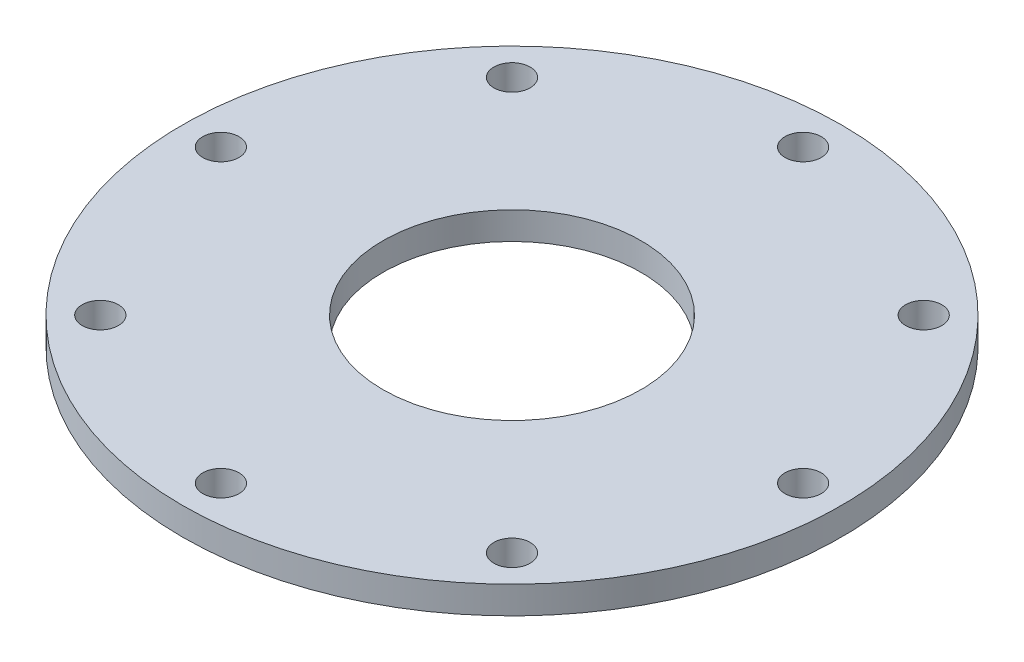
ISO-10303-21;
HEADER;
FILE_DESCRIPTION(('STEP AP214'),'2;1');
FILE_NAME('part.step','',(''),(''),'','','');
FILE_SCHEMA(('AUTOMOTIVE_DESIGN { 1 0 10303 214 1 1 1 1 }'));
ENDSEC;
DATA;
#1=APPLICATION_CONTEXT('core data for automotive mechanical design processes');
#2=APPLICATION_PROTOCOL_DEFINITION('international standard','automotive_design',2000,#1);
#3=PRODUCT_CONTEXT('',#1,'mechanical');
#4=PRODUCT('Part','Part','',(#3));
#5=PRODUCT_RELATED_PRODUCT_CATEGORY('part','',(#4));
#6=PRODUCT_DEFINITION_FORMATION('','',#4);
#7=PRODUCT_DEFINITION_CONTEXT('part definition',#1,'design');
#8=PRODUCT_DEFINITION('design','',#6,#7);
#9=PRODUCT_DEFINITION_SHAPE('','',#8);
#10=(LENGTH_UNIT() NAMED_UNIT(*) SI_UNIT(.MILLI.,.METRE.));
#11=(NAMED_UNIT(*) PLANE_ANGLE_UNIT() SI_UNIT($,.RADIAN.));
#12=(NAMED_UNIT(*) SI_UNIT($,.STERADIAN.) SOLID_ANGLE_UNIT());
#13=UNCERTAINTY_MEASURE_WITH_UNIT(LENGTH_MEASURE(1.E-05),#10,'distance_accuracy_value','');
#14=(GEOMETRIC_REPRESENTATION_CONTEXT(3) GLOBAL_UNCERTAINTY_ASSIGNED_CONTEXT((#13)) GLOBAL_UNIT_ASSIGNED_CONTEXT((#10,
#11,#12)) REPRESENTATION_CONTEXT('',''));
#15=CARTESIAN_POINT('',(0.,0.,0.));
#16=DIRECTION('',(0.,0.,1.));
#17=DIRECTION('',(1.,0.,0.));
#18=AXIS2_PLACEMENT_3D('',#15,#16,#17);
#19=CARTESIAN_POINT('',(0.,5.,0.));
#20=DIRECTION('',(0.,1.,0.));
#21=DIRECTION('',(0.,0.,1.));
#22=AXIS2_PLACEMENT_3D('',#19,#20,#21);
#23=PLANE('',#22);
#24=CARTESIAN_POINT('',(0.,5.,-53.));
#25=DIRECTION('',(0.,1.,0.));
#26=DIRECTION('',(0.,0.,1.));
#27=AXIS2_PLACEMENT_3D('',#24,#25,#26);
#28=CIRCLE('',#27,3.3);
#29=CARTESIAN_POINT('',(0.,5.,-49.7));
#30=VERTEX_POINT('',#29);
#31=EDGE_CURVE('E125',#30,#30,#28,.T.);
#32=ORIENTED_EDGE('',*,*,#31,.F.);
#33=EDGE_LOOP('',(#32));
#34=FACE_BOUND('',#33,.T.);
#35=CARTESIAN_POINT('',(37.476659402887,5.,-37.476659402887));
#36=DIRECTION('',(0.,1.,0.));
#37=DIRECTION('',(0.,0.,1.));
#38=AXIS2_PLACEMENT_3D('',#35,#36,#37);
#39=CIRCLE('',#38,3.3);
#40=CARTESIAN_POINT('',(37.476659402887,5.,-34.176659402887));
#41=VERTEX_POINT('',#40);
#42=EDGE_CURVE('E117',#41,#41,#39,.T.);
#43=ORIENTED_EDGE('',*,*,#42,.F.);
#44=EDGE_LOOP('',(#43));
#45=FACE_BOUND('',#44,.T.);
#46=CARTESIAN_POINT('',(53.,5.,0.));
#47=DIRECTION('',(0.,1.,0.));
#48=DIRECTION('',(0.,0.,1.));
#49=AXIS2_PLACEMENT_3D('',#46,#47,#48);
#50=CIRCLE('',#49,3.3);
#51=CARTESIAN_POINT('',(53.,5.,3.29999999999999));
#52=VERTEX_POINT('',#51);
#53=EDGE_CURVE('E109',#52,#52,#50,.T.);
#54=ORIENTED_EDGE('',*,*,#53,.F.);
#55=EDGE_LOOP('',(#54));
#56=FACE_BOUND('',#55,.T.);
#57=CARTESIAN_POINT('',(37.476659402887,5.,37.476659402887));
#58=DIRECTION('',(0.,1.,0.));
#59=DIRECTION('',(0.,0.,1.));
#60=AXIS2_PLACEMENT_3D('',#57,#58,#59);
#61=CIRCLE('',#60,3.3);
#62=CARTESIAN_POINT('',(37.476659402887,5.,40.776659402887));
#63=VERTEX_POINT('',#62);
#64=EDGE_CURVE('E101',#63,#63,#61,.T.);
#65=ORIENTED_EDGE('',*,*,#64,.F.);
#66=EDGE_LOOP('',(#65));
#67=FACE_BOUND('',#66,.T.);
#68=CARTESIAN_POINT('',(0.,5.,53.));
#69=DIRECTION('',(0.,1.,0.));
#70=DIRECTION('',(0.,0.,1.));
#71=AXIS2_PLACEMENT_3D('',#68,#69,#70);
#72=CIRCLE('',#71,3.3);
#73=CARTESIAN_POINT('',(0.,5.,56.3));
#74=VERTEX_POINT('',#73);
#75=EDGE_CURVE('E93',#74,#74,#72,.T.);
#76=ORIENTED_EDGE('',*,*,#75,.F.);
#77=EDGE_LOOP('',(#76));
#78=FACE_BOUND('',#77,.T.);
#79=CARTESIAN_POINT('',(-37.476659402887,5.,37.476659402887));
#80=DIRECTION('',(0.,1.,0.));
#81=DIRECTION('',(0.,0.,1.));
#82=AXIS2_PLACEMENT_3D('',#79,#80,#81);
#83=CIRCLE('',#82,3.3);
#84=CARTESIAN_POINT('',(-37.476659402887,5.,40.776659402887));
#85=VERTEX_POINT('',#84);
#86=EDGE_CURVE('E85',#85,#85,#83,.T.);
#87=ORIENTED_EDGE('',*,*,#86,.F.);
#88=EDGE_LOOP('',(#87));
#89=FACE_BOUND('',#88,.T.);
#90=CARTESIAN_POINT('',(-53.,5.,0.));
#91=DIRECTION('',(0.,1.,0.));
#92=DIRECTION('',(0.,0.,1.));
#93=AXIS2_PLACEMENT_3D('',#90,#91,#92);
#94=CIRCLE('',#93,3.3);
#95=CARTESIAN_POINT('',(-53.,5.,3.30000000000001));
#96=VERTEX_POINT('',#95);
#97=EDGE_CURVE('E77',#96,#96,#94,.T.);
#98=ORIENTED_EDGE('',*,*,#97,.F.);
#99=EDGE_LOOP('',(#98));
#100=FACE_BOUND('',#99,.T.);
#101=CARTESIAN_POINT('',(-37.476659402887,5.,-37.476659402887));
#102=DIRECTION('',(0.,1.,0.));
#103=DIRECTION('',(0.,0.,1.));
#104=AXIS2_PLACEMENT_3D('',#101,#102,#103);
#105=CIRCLE('',#104,3.3);
#106=CARTESIAN_POINT('',(-37.476659402887,5.,-34.176659402887));
#107=VERTEX_POINT('',#106);
#108=EDGE_CURVE('E69',#107,#107,#105,.T.);
#109=ORIENTED_EDGE('',*,*,#108,.F.);
#110=EDGE_LOOP('',(#109));
#111=FACE_BOUND('',#110,.T.);
#112=CARTESIAN_POINT('',(0.,5.,0.));
#113=DIRECTION('',(0.,1.,0.));
#114=DIRECTION('',(0.,0.,1.));
#115=AXIS2_PLACEMENT_3D('',#112,#113,#114);
#116=CIRCLE('',#115,60.);
#117=CARTESIAN_POINT('',(0.,5.,60.));
#118=VERTEX_POINT('',#117);
#119=EDGE_CURVE('E10',#118,#118,#116,.T.);
#120=ORIENTED_EDGE('',*,*,#119,.T.);
#121=EDGE_LOOP('',(#120));
#122=FACE_BOUND('',#121,.T.);
#123=CARTESIAN_POINT('',(0.,5.,0.));
#124=DIRECTION('',(0.,1.,0.));
#125=DIRECTION('',(0.,0.,1.));
#126=AXIS2_PLACEMENT_3D('',#123,#124,#125);
#127=CIRCLE('',#126,23.5);
#128=CARTESIAN_POINT('',(0.,5.,23.5));
#129=VERTEX_POINT('',#128);
#130=EDGE_CURVE('E56',#129,#129,#127,.T.);
#131=ORIENTED_EDGE('',*,*,#130,.F.);
#132=EDGE_LOOP('',(#131));
#133=FACE_BOUND('',#132,.T.);
#134=ADVANCED_FACE('F43',(#34,#45,#56,#67,#78,#89,#100,#111,#122,#133),#23,.T.);
#135=CARTESIAN_POINT('',(0.,0.,0.));
#136=DIRECTION('',(0.,1.,0.));
#137=DIRECTION('',(0.,0.,1.));
#138=AXIS2_PLACEMENT_3D('',#135,#136,#137);
#139=PLANE('',#138);
#140=CARTESIAN_POINT('',(0.,0.,-53.));
#141=DIRECTION('',(0.,1.,0.));
#142=DIRECTION('',(0.,0.,1.));
#143=AXIS2_PLACEMENT_3D('',#140,#141,#142);
#144=CIRCLE('',#143,3.3);
#145=CARTESIAN_POINT('',(0.,0.,-49.7));
#146=VERTEX_POINT('',#145);
#147=EDGE_CURVE('E121',#146,#146,#144,.T.);
#148=ORIENTED_EDGE('',*,*,#147,.T.);
#149=EDGE_LOOP('',(#148));
#150=FACE_BOUND('',#149,.T.);
#151=CARTESIAN_POINT('',(37.476659402887,0.,-37.476659402887));
#152=DIRECTION('',(0.,1.,0.));
#153=DIRECTION('',(0.,0.,1.));
#154=AXIS2_PLACEMENT_3D('',#151,#152,#153);
#155=CIRCLE('',#154,3.3);
#156=CARTESIAN_POINT('',(37.476659402887,0.,-34.176659402887));
#157=VERTEX_POINT('',#156);
#158=EDGE_CURVE('E113',#157,#157,#155,.T.);
#159=ORIENTED_EDGE('',*,*,#158,.T.);
#160=EDGE_LOOP('',(#159));
#161=FACE_BOUND('',#160,.T.);
#162=CARTESIAN_POINT('',(53.,0.,0.));
#163=DIRECTION('',(0.,1.,0.));
#164=DIRECTION('',(0.,0.,1.));
#165=AXIS2_PLACEMENT_3D('',#162,#163,#164);
#166=CIRCLE('',#165,3.3);
#167=CARTESIAN_POINT('',(53.,0.,3.29999999999999));
#168=VERTEX_POINT('',#167);
#169=EDGE_CURVE('E105',#168,#168,#166,.T.);
#170=ORIENTED_EDGE('',*,*,#169,.T.);
#171=EDGE_LOOP('',(#170));
#172=FACE_BOUND('',#171,.T.);
#173=CARTESIAN_POINT('',(37.476659402887,0.,37.476659402887));
#174=DIRECTION('',(0.,1.,0.));
#175=DIRECTION('',(0.,0.,1.));
#176=AXIS2_PLACEMENT_3D('',#173,#174,#175);
#177=CIRCLE('',#176,3.3);
#178=CARTESIAN_POINT('',(37.476659402887,0.,40.776659402887));
#179=VERTEX_POINT('',#178);
#180=EDGE_CURVE('E97',#179,#179,#177,.T.);
#181=ORIENTED_EDGE('',*,*,#180,.T.);
#182=EDGE_LOOP('',(#181));
#183=FACE_BOUND('',#182,.T.);
#184=CARTESIAN_POINT('',(0.,0.,53.));
#185=DIRECTION('',(0.,1.,0.));
#186=DIRECTION('',(0.,0.,1.));
#187=AXIS2_PLACEMENT_3D('',#184,#185,#186);
#188=CIRCLE('',#187,3.3);
#189=CARTESIAN_POINT('',(0.,0.,56.3));
#190=VERTEX_POINT('',#189);
#191=EDGE_CURVE('E89',#190,#190,#188,.T.);
#192=ORIENTED_EDGE('',*,*,#191,.T.);
#193=EDGE_LOOP('',(#192));
#194=FACE_BOUND('',#193,.T.);
#195=CARTESIAN_POINT('',(-37.476659402887,0.,37.476659402887));
#196=DIRECTION('',(0.,1.,0.));
#197=DIRECTION('',(0.,0.,1.));
#198=AXIS2_PLACEMENT_3D('',#195,#196,#197);
#199=CIRCLE('',#198,3.3);
#200=CARTESIAN_POINT('',(-37.476659402887,0.,40.776659402887));
#201=VERTEX_POINT('',#200);
#202=EDGE_CURVE('E81',#201,#201,#199,.T.);
#203=ORIENTED_EDGE('',*,*,#202,.T.);
#204=EDGE_LOOP('',(#203));
#205=FACE_BOUND('',#204,.T.);
#206=CARTESIAN_POINT('',(-53.,0.,0.));
#207=DIRECTION('',(0.,1.,0.));
#208=DIRECTION('',(0.,0.,1.));
#209=AXIS2_PLACEMENT_3D('',#206,#207,#208);
#210=CIRCLE('',#209,3.3);
#211=CARTESIAN_POINT('',(-53.,0.,3.30000000000001));
#212=VERTEX_POINT('',#211);
#213=EDGE_CURVE('E73',#212,#212,#210,.T.);
#214=ORIENTED_EDGE('',*,*,#213,.T.);
#215=EDGE_LOOP('',(#214));
#216=FACE_BOUND('',#215,.T.);
#217=CARTESIAN_POINT('',(-37.476659402887,0.,-37.476659402887));
#218=DIRECTION('',(0.,1.,0.));
#219=DIRECTION('',(0.,0.,1.));
#220=AXIS2_PLACEMENT_3D('',#217,#218,#219);
#221=CIRCLE('',#220,3.3);
#222=CARTESIAN_POINT('',(-37.476659402887,0.,-34.176659402887));
#223=VERTEX_POINT('',#222);
#224=EDGE_CURVE('E62',#223,#223,#221,.T.);
#225=ORIENTED_EDGE('',*,*,#224,.T.);
#226=EDGE_LOOP('',(#225));
#227=FACE_BOUND('',#226,.T.);
#228=CARTESIAN_POINT('',(0.,0.,0.));
#229=DIRECTION('',(0.,1.,0.));
#230=DIRECTION('',(0.,0.,1.));
#231=AXIS2_PLACEMENT_3D('',#228,#229,#230);
#232=CIRCLE('',#231,60.);
#233=CARTESIAN_POINT('',(0.,0.,60.));
#234=VERTEX_POINT('',#233);
#235=EDGE_CURVE('E47',#234,#234,#232,.T.);
#236=ORIENTED_EDGE('',*,*,#235,.F.);
#237=EDGE_LOOP('',(#236));
#238=FACE_BOUND('',#237,.T.);
#239=CARTESIAN_POINT('',(0.,0.,0.));
#240=DIRECTION('',(0.,1.,0.));
#241=DIRECTION('',(0.,0.,1.));
#242=AXIS2_PLACEMENT_3D('',#239,#240,#241);
#243=CIRCLE('',#242,23.5);
#244=CARTESIAN_POINT('',(0.,0.,23.5));
#245=VERTEX_POINT('',#244);
#246=EDGE_CURVE('E58',#245,#245,#243,.T.);
#247=ORIENTED_EDGE('',*,*,#246,.T.);
#248=EDGE_LOOP('',(#247));
#249=FACE_BOUND('',#248,.T.);
#250=ADVANCED_FACE('F134',(#150,#161,#172,#183,#194,#205,#216,#227,#238,#249),#139,.F.);
#251=CARTESIAN_POINT('',(0.,5.,0.));
#252=DIRECTION('',(0.,-1.,0.));
#253=DIRECTION('',(0.,0.,-1.));
#254=AXIS2_PLACEMENT_3D('',#251,#252,#253);
#255=CYLINDRICAL_SURFACE('',#254,60.);
#256=ORIENTED_EDGE('',*,*,#119,.F.);
#257=EDGE_LOOP('',(#256));
#258=FACE_BOUND('',#257,.T.);
#259=ORIENTED_EDGE('',*,*,#235,.T.);
#260=EDGE_LOOP('',(#259));
#261=FACE_BOUND('',#260,.T.);
#262=ADVANCED_FACE('F45',(#258,#261),#255,.T.);
#263=CARTESIAN_POINT('',(0.,5.,0.));
#264=DIRECTION('',(0.,-1.,0.));
#265=DIRECTION('',(0.,0.,-1.));
#266=AXIS2_PLACEMENT_3D('',#263,#264,#265);
#267=CYLINDRICAL_SURFACE('',#266,23.5);
#268=ORIENTED_EDGE('',*,*,#130,.T.);
#269=EDGE_LOOP('',(#268));
#270=FACE_BOUND('',#269,.T.);
#271=ORIENTED_EDGE('',*,*,#246,.F.);
#272=EDGE_LOOP('',(#271));
#273=FACE_BOUND('',#272,.T.);
#274=ADVANCED_FACE('F152',(#270,#273),#267,.F.);
#275=CARTESIAN_POINT('',(-37.476659402887,5.,-37.476659402887));
#276=DIRECTION('',(0.,1.,0.));
#277=DIRECTION('',(0.,0.,1.));
#278=AXIS2_PLACEMENT_3D('',#275,#276,#277);
#279=CYLINDRICAL_SURFACE('',#278,3.3);
#280=ORIENTED_EDGE('',*,*,#224,.F.);
#281=EDGE_LOOP('',(#280));
#282=FACE_BOUND('',#281,.T.);
#283=ORIENTED_EDGE('',*,*,#108,.T.);
#284=EDGE_LOOP('',(#283));
#285=FACE_BOUND('',#284,.T.);
#286=ADVANCED_FACE('F155',(#282,#285),#279,.F.);
#287=CARTESIAN_POINT('',(-53.,5.,0.));
#288=DIRECTION('',(0.,1.,0.));
#289=DIRECTION('',(0.,0.,1.));
#290=AXIS2_PLACEMENT_3D('',#287,#288,#289);
#291=CYLINDRICAL_SURFACE('',#290,3.3);
#292=ORIENTED_EDGE('',*,*,#213,.F.);
#293=EDGE_LOOP('',(#292));
#294=FACE_BOUND('',#293,.T.);
#295=ORIENTED_EDGE('',*,*,#97,.T.);
#296=EDGE_LOOP('',(#295));
#297=FACE_BOUND('',#296,.T.);
#298=ADVANCED_FACE('F169',(#294,#297),#291,.F.);
#299=CARTESIAN_POINT('',(-37.476659402887,5.,37.476659402887));
#300=DIRECTION('',(0.,1.,0.));
#301=DIRECTION('',(0.,0.,1.));
#302=AXIS2_PLACEMENT_3D('',#299,#300,#301);
#303=CYLINDRICAL_SURFACE('',#302,3.3);
#304=ORIENTED_EDGE('',*,*,#202,.F.);
#305=EDGE_LOOP('',(#304));
#306=FACE_BOUND('',#305,.T.);
#307=ORIENTED_EDGE('',*,*,#86,.T.);
#308=EDGE_LOOP('',(#307));
#309=FACE_BOUND('',#308,.T.);
#310=ADVANCED_FACE('F173',(#306,#309),#303,.F.);
#311=CARTESIAN_POINT('',(0.,5.,53.));
#312=DIRECTION('',(0.,1.,0.));
#313=DIRECTION('',(0.,0.,1.));
#314=AXIS2_PLACEMENT_3D('',#311,#312,#313);
#315=CYLINDRICAL_SURFACE('',#314,3.3);
#316=ORIENTED_EDGE('',*,*,#191,.F.);
#317=EDGE_LOOP('',(#316));
#318=FACE_BOUND('',#317,.T.);
#319=ORIENTED_EDGE('',*,*,#75,.T.);
#320=EDGE_LOOP('',(#319));
#321=FACE_BOUND('',#320,.T.);
#322=ADVANCED_FACE('F177',(#318,#321),#315,.F.);
#323=CARTESIAN_POINT('',(37.476659402887,5.,37.476659402887));
#324=DIRECTION('',(0.,1.,0.));
#325=DIRECTION('',(0.,0.,1.));
#326=AXIS2_PLACEMENT_3D('',#323,#324,#325);
#327=CYLINDRICAL_SURFACE('',#326,3.3);
#328=ORIENTED_EDGE('',*,*,#180,.F.);
#329=EDGE_LOOP('',(#328));
#330=FACE_BOUND('',#329,.T.);
#331=ORIENTED_EDGE('',*,*,#64,.T.);
#332=EDGE_LOOP('',(#331));
#333=FACE_BOUND('',#332,.T.);
#334=ADVANCED_FACE('F181',(#330,#333),#327,.F.);
#335=CARTESIAN_POINT('',(53.,5.,0.));
#336=DIRECTION('',(0.,1.,0.));
#337=DIRECTION('',(0.,0.,1.));
#338=AXIS2_PLACEMENT_3D('',#335,#336,#337);
#339=CYLINDRICAL_SURFACE('',#338,3.3);
#340=ORIENTED_EDGE('',*,*,#169,.F.);
#341=EDGE_LOOP('',(#340));
#342=FACE_BOUND('',#341,.T.);
#343=ORIENTED_EDGE('',*,*,#53,.T.);
#344=EDGE_LOOP('',(#343));
#345=FACE_BOUND('',#344,.T.);
#346=ADVANCED_FACE('F185',(#342,#345),#339,.F.);
#347=CARTESIAN_POINT('',(37.476659402887,5.,-37.476659402887));
#348=DIRECTION('',(0.,1.,0.));
#349=DIRECTION('',(0.,0.,1.));
#350=AXIS2_PLACEMENT_3D('',#347,#348,#349);
#351=CYLINDRICAL_SURFACE('',#350,3.3);
#352=ORIENTED_EDGE('',*,*,#158,.F.);
#353=EDGE_LOOP('',(#352));
#354=FACE_BOUND('',#353,.T.);
#355=ORIENTED_EDGE('',*,*,#42,.T.);
#356=EDGE_LOOP('',(#355));
#357=FACE_BOUND('',#356,.T.);
#358=ADVANCED_FACE('F189',(#354,#357),#351,.F.);
#359=CARTESIAN_POINT('',(0.,5.,-53.));
#360=DIRECTION('',(0.,1.,0.));
#361=DIRECTION('',(0.,0.,1.));
#362=AXIS2_PLACEMENT_3D('',#359,#360,#361);
#363=CYLINDRICAL_SURFACE('',#362,3.3);
#364=ORIENTED_EDGE('',*,*,#147,.F.);
#365=EDGE_LOOP('',(#364));
#366=FACE_BOUND('',#365,.T.);
#367=ORIENTED_EDGE('',*,*,#31,.T.);
#368=EDGE_LOOP('',(#367));
#369=FACE_BOUND('',#368,.T.);
#370=ADVANCED_FACE('F130',(#366,#369),#363,.F.);
#371=CLOSED_SHELL('',(#134,#250,#262,#274,#286,#298,#310,#322,#334,#346,#358,#370));
#372=MANIFOLD_SOLID_BREP('B2',#371);
#373=ADVANCED_BREP_SHAPE_REPRESENTATION('',(#18,#372),#14);
#374=SHAPE_DEFINITION_REPRESENTATION(#9,#373);
ENDSEC;
END-ISO-10303-21;
